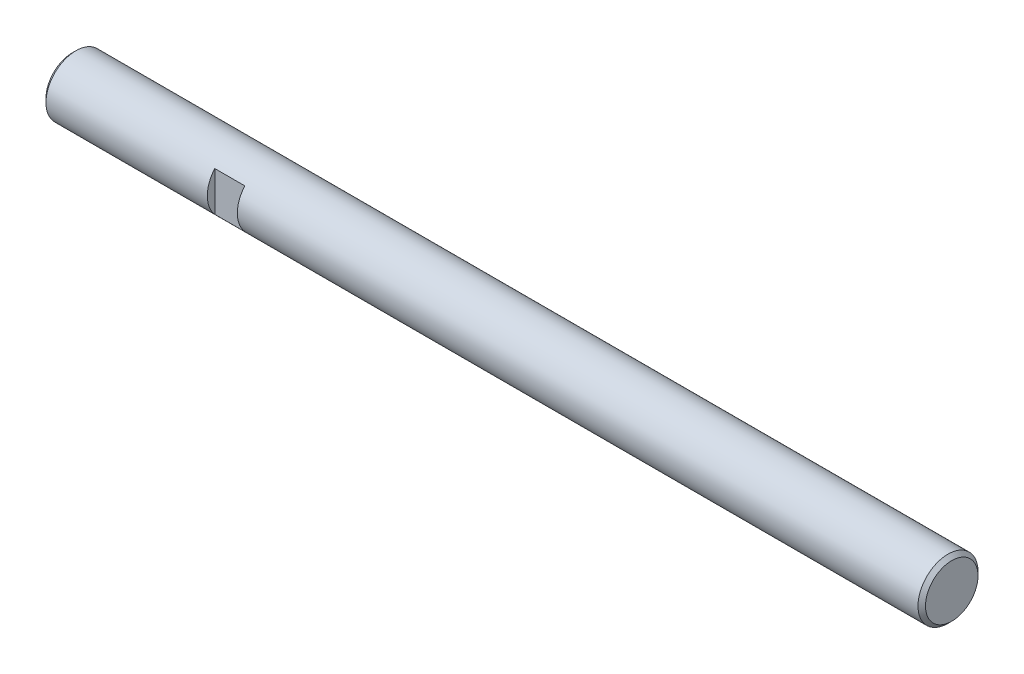
ISO-10303-21;
HEADER;
FILE_DESCRIPTION(('STEP AP214'),'2;1');
FILE_NAME('part.step','',(''),(''),'','','');
FILE_SCHEMA(('AUTOMOTIVE_DESIGN { 1 0 10303 214 1 1 1 1 }'));
ENDSEC;
DATA;
#1=APPLICATION_CONTEXT('core data for automotive mechanical design processes');
#2=APPLICATION_PROTOCOL_DEFINITION('international standard','automotive_design',2000,#1);
#3=PRODUCT_CONTEXT('',#1,'mechanical');
#4=PRODUCT('Part','Part','',(#3));
#5=PRODUCT_RELATED_PRODUCT_CATEGORY('part','',(#4));
#6=PRODUCT_DEFINITION_FORMATION('','',#4);
#7=PRODUCT_DEFINITION_CONTEXT('part definition',#1,'design');
#8=PRODUCT_DEFINITION('design','',#6,#7);
#9=PRODUCT_DEFINITION_SHAPE('','',#8);
#10=(LENGTH_UNIT() NAMED_UNIT(*) SI_UNIT(.MILLI.,.METRE.));
#11=(NAMED_UNIT(*) PLANE_ANGLE_UNIT() SI_UNIT($,.RADIAN.));
#12=(NAMED_UNIT(*) SI_UNIT($,.STERADIAN.) SOLID_ANGLE_UNIT());
#13=UNCERTAINTY_MEASURE_WITH_UNIT(LENGTH_MEASURE(1.E-05),#10,'distance_accuracy_value','');
#14=(GEOMETRIC_REPRESENTATION_CONTEXT(3) GLOBAL_UNCERTAINTY_ASSIGNED_CONTEXT((#13)) GLOBAL_UNIT_ASSIGNED_CONTEXT((#10,
#11,#12)) REPRESENTATION_CONTEXT('',''));
#15=CARTESIAN_POINT('',(0.,0.,0.));
#16=DIRECTION('',(0.,0.,1.));
#17=DIRECTION('',(1.,0.,0.));
#18=AXIS2_PLACEMENT_3D('',#15,#16,#17);
#19=CARTESIAN_POINT('',(117.2,0.,0.));
#20=DIRECTION('',(1.,0.,0.));
#21=DIRECTION('',(0.,0.,-1.));
#22=AXIS2_PLACEMENT_3D('',#19,#20,#21);
#23=CYLINDRICAL_SURFACE('',#22,4.);
#24=CARTESIAN_POINT('',(116.7,0.,0.));
#25=DIRECTION('',(1.,0.,0.));
#26=DIRECTION('',(0.,0.,-1.));
#27=AXIS2_PLACEMENT_3D('',#24,#25,#26);
#28=CIRCLE('',#27,4.);
#29=CARTESIAN_POINT('',(116.7,0.,-4.));
#30=VERTEX_POINT('',#29);
#31=EDGE_CURVE('E83',#30,#30,#28,.T.);
#32=ORIENTED_EDGE('',*,*,#31,.F.);
#33=EDGE_LOOP('',(#32));
#34=FACE_BOUND('',#33,.T.);
#35=CARTESIAN_POINT('',(0.5,0.,0.));
#36=DIRECTION('',(1.,0.,0.));
#37=DIRECTION('',(0.,0.,-1.));
#38=AXIS2_PLACEMENT_3D('',#35,#36,#37);
#39=CIRCLE('',#38,4.);
#40=CARTESIAN_POINT('',(0.5,0.,-4.));
#41=VERTEX_POINT('',#40);
#42=EDGE_CURVE('E78',#41,#41,#39,.T.);
#43=ORIENTED_EDGE('',*,*,#42,.T.);
#44=EDGE_LOOP('',(#43));
#45=FACE_BOUND('',#44,.T.);
#46=CARTESIAN_POINT('',(26.,0.,0.));
#47=DIRECTION('',(-1.,0.,0.));
#48=DIRECTION('',(0.,-0.661437827766147,0.75));
#49=AXIS2_PLACEMENT_3D('',#46,#47,#48);
#50=CIRCLE('',#49,4.);
#51=CARTESIAN_POINT('',(26.,-2.64575131106459,3.));
#52=VERTEX_POINT('',#51);
#53=CARTESIAN_POINT('',(26.,2.64575131106459,3.));
#54=VERTEX_POINT('',#53);
#55=EDGE_CURVE('E67',#52,#54,#50,.T.);
#56=ORIENTED_EDGE('',*,*,#55,.F.);
#57=DIRECTION('',(1.,0.,0.));
#58=VECTOR('',#57,1.);
#59=CARTESIAN_POINT('',(22.,-2.64575131106459,3.));
#60=LINE('',#59,#58);
#61=CARTESIAN_POINT('',(22.,-2.64575131106459,3.));
#62=VERTEX_POINT('',#61);
#63=EDGE_CURVE('E55',#62,#52,#60,.T.);
#64=ORIENTED_EDGE('',*,*,#63,.F.);
#65=CARTESIAN_POINT('',(22.,0.,0.));
#66=DIRECTION('',(1.,0.,0.));
#67=DIRECTION('',(0.,0.661437827766148,0.75));
#68=AXIS2_PLACEMENT_3D('',#65,#66,#67);
#69=CIRCLE('',#68,4.);
#70=CARTESIAN_POINT('',(22.,2.64575131106459,3.));
#71=VERTEX_POINT('',#70);
#72=EDGE_CURVE('E66',#71,#62,#69,.T.);
#73=ORIENTED_EDGE('',*,*,#72,.F.);
#74=DIRECTION('',(-1.,0.,0.));
#75=VECTOR('',#74,1.);
#76=CARTESIAN_POINT('',(26.,2.64575131106459,3.));
#77=LINE('',#76,#75);
#78=EDGE_CURVE('E76',#54,#71,#77,.T.);
#79=ORIENTED_EDGE('',*,*,#78,.F.);
#80=EDGE_LOOP('',(#56,#64,#73,#79));
#81=FACE_BOUND('',#80,.T.);
#82=DIRECTION('',(1.,0.,0.));
#83=VECTOR('',#82,1.);
#84=CARTESIAN_POINT('',(22.,-1.27520055582103,-3.79128784747792));
#85=LINE('',#84,#83);
#86=CARTESIAN_POINT('',(22.,-1.27520055582103,-3.79128784747792));
#87=VERTEX_POINT('',#86);
#88=CARTESIAN_POINT('',(26.,-1.27520055582103,-3.79128784747792));
#89=VERTEX_POINT('',#88);
#90=EDGE_CURVE('E97',#87,#89,#85,.T.);
#91=ORIENTED_EDGE('',*,*,#90,.F.);
#92=CARTESIAN_POINT('',(22.,0.,0.));
#93=DIRECTION('',(1.,0.,0.));
#94=DIRECTION('',(0.,-0.980237966721403,0.197821961869479));
#95=AXIS2_PLACEMENT_3D('',#92,#93,#94);
#96=CIRCLE('',#95,4.);
#97=CARTESIAN_POINT('',(22.,-3.92095186688561,0.791287847477916));
#98=VERTEX_POINT('',#97);
#99=EDGE_CURVE('E103',#98,#87,#96,.T.);
#100=ORIENTED_EDGE('',*,*,#99,.F.);
#101=DIRECTION('',(-1.,0.,0.));
#102=VECTOR('',#101,1.);
#103=CARTESIAN_POINT('',(26.,-3.92095186688562,0.791287847477915));
#104=LINE('',#103,#102);
#105=CARTESIAN_POINT('',(26.,-3.92095186688562,0.791287847477915));
#106=VERTEX_POINT('',#105);
#107=EDGE_CURVE('E108',#106,#98,#104,.T.);
#108=ORIENTED_EDGE('',*,*,#107,.F.);
#109=CARTESIAN_POINT('',(26.,0.,0.));
#110=DIRECTION('',(-1.,0.,0.));
#111=DIRECTION('',(0.,-0.318800138955258,-0.947821961869479));
#112=AXIS2_PLACEMENT_3D('',#109,#110,#111);
#113=CIRCLE('',#112,4.);
#114=EDGE_CURVE('E34',#89,#106,#113,.T.);
#115=ORIENTED_EDGE('',*,*,#114,.F.);
#116=EDGE_LOOP('',(#91,#100,#108,#115));
#117=FACE_BOUND('',#116,.T.);
#118=ADVANCED_FACE('F16',(#34,#45,#81,#117),#23,.T.);
#119=CARTESIAN_POINT('',(116.7,0.,0.));
#120=DIRECTION('',(-1.,0.,0.));
#121=DIRECTION('',(0.,0.,1.));
#122=AXIS2_PLACEMENT_3D('',#119,#120,#121);
#123=CONICAL_SURFACE('',#122,4.,0.785398163397462);
#124=CARTESIAN_POINT('',(117.2,0.,0.));
#125=DIRECTION('',(1.,0.,0.));
#126=DIRECTION('',(0.,0.,-1.));
#127=AXIS2_PLACEMENT_3D('',#124,#125,#126);
#128=CIRCLE('',#127,3.49999999999999);
#129=CARTESIAN_POINT('',(117.2,0.,-3.49999999999999));
#130=VERTEX_POINT('',#129);
#131=EDGE_CURVE('E118',#130,#130,#128,.T.);
#132=ORIENTED_EDGE('',*,*,#131,.F.);
#133=EDGE_LOOP('',(#132));
#134=FACE_BOUND('',#133,.T.);
#135=ORIENTED_EDGE('',*,*,#31,.T.);
#136=EDGE_LOOP('',(#135));
#137=FACE_BOUND('',#136,.T.);
#138=ADVANCED_FACE('F151',(#134,#137),#123,.T.);
#139=CARTESIAN_POINT('',(0.,0.,0.));
#140=DIRECTION('',(1.,0.,0.));
#141=DIRECTION('',(0.,0.,-1.));
#142=AXIS2_PLACEMENT_3D('',#139,#140,#141);
#143=CONICAL_SURFACE('',#142,3.5,0.785398163397448);
#144=ORIENTED_EDGE('',*,*,#42,.F.);
#145=EDGE_LOOP('',(#144));
#146=FACE_BOUND('',#145,.T.);
#147=CARTESIAN_POINT('',(0.,0.,0.));
#148=DIRECTION('',(1.,0.,0.));
#149=DIRECTION('',(0.,0.,-1.));
#150=AXIS2_PLACEMENT_3D('',#147,#148,#149);
#151=CIRCLE('',#150,3.5);
#152=CARTESIAN_POINT('',(0.,0.,-3.5));
#153=VERTEX_POINT('',#152);
#154=EDGE_CURVE('E73',#153,#153,#151,.T.);
#155=ORIENTED_EDGE('',*,*,#154,.T.);
#156=EDGE_LOOP('',(#155));
#157=FACE_BOUND('',#156,.T.);
#158=ADVANCED_FACE('F140',(#146,#157),#143,.T.);
#159=CARTESIAN_POINT('',(26.,8.,4.));
#160=DIRECTION('',(-1.,0.,0.));
#161=DIRECTION('',(0.,0.,1.));
#162=AXIS2_PLACEMENT_3D('',#159,#160,#161);
#163=PLANE('',#162);
#164=ORIENTED_EDGE('',*,*,#55,.T.);
#165=DIRECTION('',(0.,-1.,0.));
#166=VECTOR('',#165,1.);
#167=CARTESIAN_POINT('',(26.,2.64575131106459,3.));
#168=LINE('',#167,#166);
#169=EDGE_CURVE('E59',#54,#52,#168,.T.);
#170=ORIENTED_EDGE('',*,*,#169,.T.);
#171=EDGE_LOOP('',(#164,#170));
#172=FACE_BOUND('',#171,.T.);
#173=ADVANCED_FACE('F71',(#172),#163,.T.);
#174=CARTESIAN_POINT('',(26.,8.,3.));
#175=DIRECTION('',(0.,0.,1.));
#176=DIRECTION('',(1.,0.,0.));
#177=AXIS2_PLACEMENT_3D('',#174,#175,#176);
#178=PLANE('',#177);
#179=ORIENTED_EDGE('',*,*,#63,.T.);
#180=ORIENTED_EDGE('',*,*,#169,.F.);
#181=ORIENTED_EDGE('',*,*,#78,.T.);
#182=DIRECTION('',(0.,-1.,0.));
#183=VECTOR('',#182,1.);
#184=CARTESIAN_POINT('',(22.,2.64575131106459,3.));
#185=LINE('',#184,#183);
#186=EDGE_CURVE('E61',#71,#62,#185,.T.);
#187=ORIENTED_EDGE('',*,*,#186,.T.);
#188=EDGE_LOOP('',(#179,#180,#181,#187));
#189=FACE_BOUND('',#188,.T.);
#190=ADVANCED_FACE('F57',(#189),#178,.T.);
#191=CARTESIAN_POINT('',(22.,8.,3.));
#192=DIRECTION('',(1.,0.,0.));
#193=DIRECTION('',(0.,0.,-1.));
#194=AXIS2_PLACEMENT_3D('',#191,#192,#193);
#195=PLANE('',#194);
#196=ORIENTED_EDGE('',*,*,#186,.F.);
#197=ORIENTED_EDGE('',*,*,#72,.T.);
#198=EDGE_LOOP('',(#196,#197));
#199=FACE_BOUND('',#198,.T.);
#200=ADVANCED_FACE('F169',(#199),#195,.T.);
#201=CARTESIAN_POINT('',(26.,-6.59807621135331,5.4282032302755));
#202=DIRECTION('',(0.,-0.866025403784439,-0.5));
#203=DIRECTION('',(0.,0.5,-0.866025403784439));
#204=AXIS2_PLACEMENT_3D('',#201,#202,#203);
#205=PLANE('',#204);
#206=ORIENTED_EDGE('',*,*,#90,.T.);
#207=DIRECTION('',(0.,0.5,-0.866025403784439));
#208=VECTOR('',#207,1.);
#209=CARTESIAN_POINT('',(26.,-3.92095186688561,0.791287847477917));
#210=LINE('',#209,#208);
#211=EDGE_CURVE('E26',#106,#89,#210,.T.);
#212=ORIENTED_EDGE('',*,*,#211,.F.);
#213=ORIENTED_EDGE('',*,*,#107,.T.);
#214=DIRECTION('',(0.,0.5,-0.866025403784439));
#215=VECTOR('',#214,1.);
#216=CARTESIAN_POINT('',(22.,-3.92095186688561,0.791287847477915));
#217=LINE('',#216,#215);
#218=EDGE_CURVE('E10',#98,#87,#217,.T.);
#219=ORIENTED_EDGE('',*,*,#218,.T.);
#220=EDGE_LOOP('',(#206,#212,#213,#219));
#221=FACE_BOUND('',#220,.T.);
#222=ADVANCED_FACE('F172',(#221),#205,.T.);
#223=CARTESIAN_POINT('',(22.,-6.59807621135331,5.4282032302755));
#224=DIRECTION('',(1.,0.,0.));
#225=DIRECTION('',(0.,0.,-1.));
#226=AXIS2_PLACEMENT_3D('',#223,#224,#225);
#227=PLANE('',#226);
#228=ORIENTED_EDGE('',*,*,#99,.T.);
#229=ORIENTED_EDGE('',*,*,#218,.F.);
#230=EDGE_LOOP('',(#228,#229));
#231=FACE_BOUND('',#230,.T.);
#232=ADVANCED_FACE('F176',(#231),#227,.T.);
#233=CARTESIAN_POINT('',(26.,-7.46410161513775,4.9282032302755));
#234=DIRECTION('',(-1.,0.,0.));
#235=DIRECTION('',(0.,0.,1.));
#236=AXIS2_PLACEMENT_3D('',#233,#234,#235);
#237=PLANE('',#236);
#238=ORIENTED_EDGE('',*,*,#211,.T.);
#239=ORIENTED_EDGE('',*,*,#114,.T.);
#240=EDGE_LOOP('',(#238,#239));
#241=FACE_BOUND('',#240,.T.);
#242=ADVANCED_FACE('F148',(#241),#237,.T.);
#243=CARTESIAN_POINT('',(117.2,3.5,0.));
#244=DIRECTION('',(-1.,0.,0.));
#245=DIRECTION('',(0.,0.,1.));
#246=AXIS2_PLACEMENT_3D('',#243,#244,#245);
#247=PLANE('',#246);
#248=ORIENTED_EDGE('',*,*,#131,.T.);
#249=EDGE_LOOP('',(#248));
#250=FACE_BOUND('',#249,.T.);
#251=ADVANCED_FACE('F143',(#250),#247,.F.);
#252=CARTESIAN_POINT('',(0.,0.,0.));
#253=DIRECTION('',(1.,0.,0.));
#254=DIRECTION('',(0.,0.,-1.));
#255=AXIS2_PLACEMENT_3D('',#252,#253,#254);
#256=PLANE('',#255);
#257=ORIENTED_EDGE('',*,*,#154,.F.);
#258=EDGE_LOOP('',(#257));
#259=FACE_BOUND('',#258,.T.);
#260=ADVANCED_FACE('F18',(#259),#256,.F.);
#261=CLOSED_SHELL('',(#118,#138,#158,#173,#190,#200,#222,#232,#242,#251,#260));
#262=MANIFOLD_SOLID_BREP('B1',#261);
#263=ADVANCED_BREP_SHAPE_REPRESENTATION('',(#18,#262),#14);
#264=SHAPE_DEFINITION_REPRESENTATION(#9,#263);
ENDSEC;
END-ISO-10303-21;
